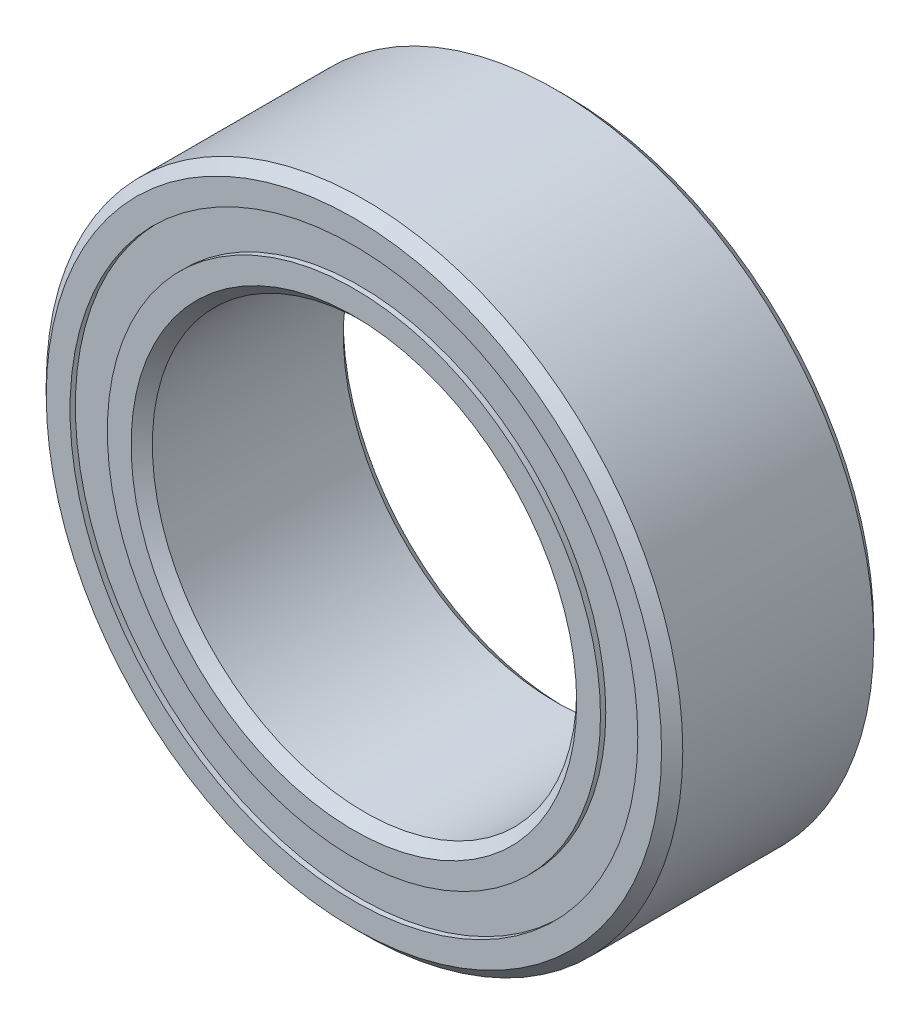
ISO-10303-21;
HEADER;
FILE_DESCRIPTION(('STEP AP214'),'2;1');
FILE_NAME('part.step','',(''),(''),'','','');
FILE_SCHEMA(('AUTOMOTIVE_DESIGN { 1 0 10303 214 1 1 1 1 }'));
ENDSEC;
DATA;
#1=APPLICATION_CONTEXT('core data for automotive mechanical design processes');
#2=APPLICATION_PROTOCOL_DEFINITION('international standard','automotive_design',2000,#1);
#3=PRODUCT_CONTEXT('',#1,'mechanical');
#4=PRODUCT('Part','Part','',(#3));
#5=PRODUCT_RELATED_PRODUCT_CATEGORY('part','',(#4));
#6=PRODUCT_DEFINITION_FORMATION('','',#4);
#7=PRODUCT_DEFINITION_CONTEXT('part definition',#1,'design');
#8=PRODUCT_DEFINITION('design','',#6,#7);
#9=PRODUCT_DEFINITION_SHAPE('','',#8);
#10=(LENGTH_UNIT() NAMED_UNIT(*) SI_UNIT(.MILLI.,.METRE.));
#11=(NAMED_UNIT(*) PLANE_ANGLE_UNIT() SI_UNIT($,.RADIAN.));
#12=(NAMED_UNIT(*) SI_UNIT($,.STERADIAN.) SOLID_ANGLE_UNIT());
#13=UNCERTAINTY_MEASURE_WITH_UNIT(LENGTH_MEASURE(1.E-05),#10,'distance_accuracy_value','');
#14=(GEOMETRIC_REPRESENTATION_CONTEXT(3) GLOBAL_UNCERTAINTY_ASSIGNED_CONTEXT((#13)) GLOBAL_UNIT_ASSIGNED_CONTEXT((#10,
#11,#12)) REPRESENTATION_CONTEXT('',''));
#15=CARTESIAN_POINT('',(0.,0.,0.));
#16=DIRECTION('',(0.,0.,1.));
#17=DIRECTION('',(1.,0.,0.));
#18=AXIS2_PLACEMENT_3D('',#15,#16,#17);
#19=CARTESIAN_POINT('',(0.,4.24787087912088,-1.508125));
#20=DIRECTION('',(0.,0.,1.));
#21=DIRECTION('',(1.,0.,0.));
#22=AXIS2_PLACEMENT_3D('',#19,#20,#21);
#23=PLANE('',#22);
#24=CARTESIAN_POINT('',(0.,0.,-1.508125));
#25=DIRECTION('',(0.,0.,1.));
#26=DIRECTION('',(1.,0.,0.));
#27=AXIS2_PLACEMENT_3D('',#24,#25,#26);
#28=CIRCLE('',#27,4.24787087912088);
#29=CARTESIAN_POINT('',(4.24787087912088,0.,-1.508125));
#30=VERTEX_POINT('',#29);
#31=EDGE_CURVE('E65',#30,#30,#28,.T.);
#32=ORIENTED_EDGE('',*,*,#31,.F.);
#33=EDGE_LOOP('',(#32));
#34=FACE_BOUND('',#33,.T.);
#35=CARTESIAN_POINT('',(0.,0.,-1.508125));
#36=DIRECTION('',(0.,0.,1.));
#37=DIRECTION('',(1.,0.,0.));
#38=AXIS2_PLACEMENT_3D('',#35,#36,#37);
#39=CIRCLE('',#38,3.68962912087912);
#40=CARTESIAN_POINT('',(3.68962912087912,0.,-1.508125));
#41=VERTEX_POINT('',#40);
#42=EDGE_CURVE('E11',#41,#41,#39,.T.);
#43=ORIENTED_EDGE('',*,*,#42,.T.);
#44=EDGE_LOOP('',(#43));
#45=FACE_BOUND('',#44,.T.);
#46=ADVANCED_FACE('F47',(#34,#45),#23,.F.);
#47=CARTESIAN_POINT('',(0.,0.,1.5875));
#48=DIRECTION('',(0.,0.,1.));
#49=DIRECTION('',(1.,0.,0.));
#50=AXIS2_PLACEMENT_3D('',#47,#48,#49);
#51=CYLINDRICAL_SURFACE('',#50,3.68962912087912);
#52=ORIENTED_EDGE('',*,*,#42,.F.);
#53=EDGE_LOOP('',(#52));
#54=FACE_BOUND('',#53,.T.);
#55=CARTESIAN_POINT('',(0.,0.,-0.758760243513405));
#56=DIRECTION('',(0.,0.,1.));
#57=DIRECTION('',(1.,0.,0.));
#58=AXIS2_PLACEMENT_3D('',#55,#56,#57);
#59=CIRCLE('',#58,3.68962912087912);
#60=CARTESIAN_POINT('',(3.68962912087912,0.,-0.758760243513405));
#61=VERTEX_POINT('',#60);
#62=EDGE_CURVE('E54',#61,#61,#59,.T.);
#63=ORIENTED_EDGE('',*,*,#62,.T.);
#64=EDGE_LOOP('',(#63));
#65=FACE_BOUND('',#64,.T.);
#66=ADVANCED_FACE('F74',(#54,#65),#51,.F.);
#67=CARTESIAN_POINT('',(0.,4.24787087912088,-0.758760243513405));
#68=DIRECTION('',(0.,0.,-1.));
#69=DIRECTION('',(-1.,0.,0.));
#70=AXIS2_PLACEMENT_3D('',#67,#68,#69);
#71=PLANE('',#70);
#72=ORIENTED_EDGE('',*,*,#62,.F.);
#73=EDGE_LOOP('',(#72));
#74=FACE_BOUND('',#73,.T.);
#75=CARTESIAN_POINT('',(0.,0.,-0.758760243513405));
#76=DIRECTION('',(0.,0.,1.));
#77=DIRECTION('',(1.,0.,0.));
#78=AXIS2_PLACEMENT_3D('',#75,#76,#77);
#79=CIRCLE('',#78,4.24787087912088);
#80=CARTESIAN_POINT('',(4.24787087912088,0.,-0.758760243513405));
#81=VERTEX_POINT('',#80);
#82=EDGE_CURVE('E60',#81,#81,#79,.T.);
#83=ORIENTED_EDGE('',*,*,#82,.T.);
#84=EDGE_LOOP('',(#83));
#85=FACE_BOUND('',#84,.T.);
#86=ADVANCED_FACE('F78',(#74,#85),#71,.F.);
#87=CARTESIAN_POINT('',(0.,0.,1.5875));
#88=DIRECTION('',(0.,0.,1.));
#89=DIRECTION('',(1.,0.,0.));
#90=AXIS2_PLACEMENT_3D('',#87,#88,#89);
#91=CYLINDRICAL_SURFACE('',#90,4.24787087912088);
#92=ORIENTED_EDGE('',*,*,#82,.F.);
#93=EDGE_LOOP('',(#92));
#94=FACE_BOUND('',#93,.T.);
#95=ORIENTED_EDGE('',*,*,#31,.T.);
#96=EDGE_LOOP('',(#95));
#97=FACE_BOUND('',#96,.T.);
#98=ADVANCED_FACE('F71',(#94,#97),#91,.T.);
#99=CLOSED_SHELL('',(#46,#66,#86,#98));
#100=MANIFOLD_SOLID_BREP('B2',#99);
#101=CARTESIAN_POINT('',(0.,4.24787087912088,1.508125));
#102=DIRECTION('',(0.,0.,-1.));
#103=DIRECTION('',(-1.,0.,0.));
#104=AXIS2_PLACEMENT_3D('',#101,#102,#103);
#105=PLANE('',#104);
#106=CARTESIAN_POINT('',(0.,0.,1.508125));
#107=DIRECTION('',(0.,0.,1.));
#108=DIRECTION('',(1.,0.,0.));
#109=AXIS2_PLACEMENT_3D('',#106,#107,#108);
#110=CIRCLE('',#109,3.68962912087912);
#111=CARTESIAN_POINT('',(3.68962912087912,0.,1.508125));
#112=VERTEX_POINT('',#111);
#113=EDGE_CURVE('E46',#112,#112,#110,.T.);
#114=ORIENTED_EDGE('',*,*,#113,.F.);
#115=EDGE_LOOP('',(#114));
#116=FACE_BOUND('',#115,.T.);
#117=CARTESIAN_POINT('',(0.,0.,1.508125));
#118=DIRECTION('',(0.,0.,1.));
#119=DIRECTION('',(1.,0.,0.));
#120=AXIS2_PLACEMENT_3D('',#117,#118,#119);
#121=CIRCLE('',#120,4.24787087912088);
#122=CARTESIAN_POINT('',(4.24787087912088,0.,1.508125));
#123=VERTEX_POINT('',#122);
#124=EDGE_CURVE('E140',#123,#123,#121,.T.);
#125=ORIENTED_EDGE('',*,*,#124,.T.);
#126=EDGE_LOOP('',(#125));
#127=FACE_BOUND('',#126,.T.);
#128=ADVANCED_FACE('F122',(#116,#127),#105,.F.);
#129=CARTESIAN_POINT('',(0.,0.,1.5875));
#130=DIRECTION('',(0.,0.,1.));
#131=DIRECTION('',(1.,0.,0.));
#132=AXIS2_PLACEMENT_3D('',#129,#130,#131);
#133=CYLINDRICAL_SURFACE('',#132,3.68962912087912);
#134=CARTESIAN_POINT('',(0.,0.,0.758760243513404));
#135=DIRECTION('',(0.,0.,1.));
#136=DIRECTION('',(1.,0.,0.));
#137=AXIS2_PLACEMENT_3D('',#134,#135,#136);
#138=CIRCLE('',#137,3.68962912087912);
#139=CARTESIAN_POINT('',(3.68962912087912,0.,0.758760243513404));
#140=VERTEX_POINT('',#139);
#141=EDGE_CURVE('E129',#140,#140,#138,.T.);
#142=ORIENTED_EDGE('',*,*,#141,.F.);
#143=EDGE_LOOP('',(#142));
#144=FACE_BOUND('',#143,.T.);
#145=ORIENTED_EDGE('',*,*,#113,.T.);
#146=EDGE_LOOP('',(#145));
#147=FACE_BOUND('',#146,.T.);
#148=ADVANCED_FACE('F155',(#144,#147),#133,.F.);
#149=CARTESIAN_POINT('',(0.,4.24787087912088,0.758760243513404));
#150=DIRECTION('',(0.,0.,1.));
#151=DIRECTION('',(1.,0.,0.));
#152=AXIS2_PLACEMENT_3D('',#149,#150,#151);
#153=PLANE('',#152);
#154=CARTESIAN_POINT('',(0.,0.,0.758760243513404));
#155=DIRECTION('',(0.,0.,1.));
#156=DIRECTION('',(1.,0.,0.));
#157=AXIS2_PLACEMENT_3D('',#154,#155,#156);
#158=CIRCLE('',#157,4.24787087912088);
#159=CARTESIAN_POINT('',(4.24787087912088,0.,0.758760243513404));
#160=VERTEX_POINT('',#159);
#161=EDGE_CURVE('E136',#160,#160,#158,.T.);
#162=ORIENTED_EDGE('',*,*,#161,.F.);
#163=EDGE_LOOP('',(#162));
#164=FACE_BOUND('',#163,.T.);
#165=ORIENTED_EDGE('',*,*,#141,.T.);
#166=EDGE_LOOP('',(#165));
#167=FACE_BOUND('',#166,.T.);
#168=ADVANCED_FACE('F150',(#164,#167),#153,.F.);
#169=CARTESIAN_POINT('',(0.,0.,1.5875));
#170=DIRECTION('',(0.,0.,1.));
#171=DIRECTION('',(1.,0.,0.));
#172=AXIS2_PLACEMENT_3D('',#169,#170,#171);
#173=CYLINDRICAL_SURFACE('',#172,4.24787087912088);
#174=ORIENTED_EDGE('',*,*,#124,.F.);
#175=EDGE_LOOP('',(#174));
#176=FACE_BOUND('',#175,.T.);
#177=ORIENTED_EDGE('',*,*,#161,.T.);
#178=EDGE_LOOP('',(#177));
#179=FACE_BOUND('',#178,.T.);
#180=ADVANCED_FACE('F147',(#176,#179),#173,.T.);
#181=CLOSED_SHELL('',(#128,#148,#168,#180));
#182=MANIFOLD_SOLID_BREP('B6',#181);
#183=CARTESIAN_POINT('',(-1.98437499999996,3.43703832126952,0.));
#184=DIRECTION('',(0.,0.,1.));
#185=DIRECTION('',(-0.499999999999989,0.866025403784445,0.));
#186=AXIS2_PLACEMENT_3D('',#183,#184,#185);
#187=SPHERICAL_SURFACE('',#186,0.758760243513404);
#188=CARTESIAN_POINT('',(-1.98437499999996,3.43703832126952,0.758760243513404));
#189=VERTEX_POINT('',#188);
#190=VERTEX_LOOP('',#189);
#191=FACE_BOUND('',#190,.T.);
#192=ADVANCED_FACE('F197',(#191),#187,.T.);
#193=CLOSED_SHELL('',(#192));
#194=MANIFOLD_SOLID_BREP('B41',#193);
#195=CARTESIAN_POINT('',(-3.43703832126947,1.98437500000004,0.));
#196=DIRECTION('',(0.,0.,1.));
#197=DIRECTION('',(-0.866025403784433,0.50000000000001,0.));
#198=AXIS2_PLACEMENT_3D('',#195,#196,#197);
#199=SPHERICAL_SURFACE('',#198,0.758760243513404);
#200=CARTESIAN_POINT('',(-3.43703832126947,1.98437500000004,0.758760243513404));
#201=VERTEX_POINT('',#200);
#202=VERTEX_LOOP('',#201);
#203=FACE_BOUND('',#202,.T.);
#204=ADVANCED_FACE('F218',(#203),#199,.T.);
#205=CLOSED_SHELL('',(#204));
#206=MANIFOLD_SOLID_BREP('B118',#205);
#207=CARTESIAN_POINT('',(-3.96875,0.,0.));
#208=DIRECTION('',(0.,0.,1.));
#209=DIRECTION('',(-1.,0.,0.));
#210=AXIS2_PLACEMENT_3D('',#207,#208,#209);
#211=SPHERICAL_SURFACE('',#210,0.758760243513404);
#212=CARTESIAN_POINT('',(-3.96875,0.,0.758760243513404));
#213=VERTEX_POINT('',#212);
#214=VERTEX_LOOP('',#213);
#215=FACE_BOUND('',#214,.T.);
#216=ADVANCED_FACE('F239',(#215),#211,.T.);
#217=CLOSED_SHELL('',(#216));
#218=MANIFOLD_SOLID_BREP('B193',#217);
#219=CARTESIAN_POINT('',(-3.43703832126951,-1.98437499999997,0.));
#220=DIRECTION('',(0.,0.,1.));
#221=DIRECTION('',(-0.866025403784443,-0.499999999999992,0.));
#222=AXIS2_PLACEMENT_3D('',#219,#220,#221);
#223=SPHERICAL_SURFACE('',#222,0.758760243513404);
#224=CARTESIAN_POINT('',(-3.43703832126951,-1.98437499999997,0.758760243513404));
#225=VERTEX_POINT('',#224);
#226=VERTEX_LOOP('',#225);
#227=FACE_BOUND('',#226,.T.);
#228=ADVANCED_FACE('F260',(#227),#223,.T.);
#229=CLOSED_SHELL('',(#228));
#230=MANIFOLD_SOLID_BREP('B214',#229);
#231=CARTESIAN_POINT('',(-1.98437500000003,-3.43703832126947,0.));
#232=DIRECTION('',(0.,0.,1.));
#233=DIRECTION('',(-0.500000000000007,-0.866025403784435,0.));
#234=AXIS2_PLACEMENT_3D('',#231,#232,#233);
#235=SPHERICAL_SURFACE('',#234,0.758760243513404);
#236=CARTESIAN_POINT('',(-1.98437500000003,-3.43703832126947,0.758760243513404));
#237=VERTEX_POINT('',#236);
#238=VERTEX_LOOP('',#237);
#239=FACE_BOUND('',#238,.T.);
#240=ADVANCED_FACE('F281',(#239),#235,.T.);
#241=CLOSED_SHELL('',(#240));
#242=MANIFOLD_SOLID_BREP('B235',#241);
#243=CARTESIAN_POINT('',(0.,-3.96875,0.));
#244=DIRECTION('',(0.,0.,1.));
#245=DIRECTION('',(0.,-1.,0.));
#246=AXIS2_PLACEMENT_3D('',#243,#244,#245);
#247=SPHERICAL_SURFACE('',#246,0.758760243513404);
#248=CARTESIAN_POINT('',(0.,-3.96875,0.758760243513404));
#249=VERTEX_POINT('',#248);
#250=VERTEX_LOOP('',#249);
#251=FACE_BOUND('',#250,.T.);
#252=ADVANCED_FACE('F302',(#251),#247,.T.);
#253=CLOSED_SHELL('',(#252));
#254=MANIFOLD_SOLID_BREP('B256',#253);
#255=CARTESIAN_POINT('',(1.98437499999998,-3.4370383212695,0.));
#256=DIRECTION('',(0.,0.,1.));
#257=DIRECTION('',(0.499999999999995,-0.866025403784442,0.));
#258=AXIS2_PLACEMENT_3D('',#255,#256,#257);
#259=SPHERICAL_SURFACE('',#258,0.758760243513404);
#260=CARTESIAN_POINT('',(1.98437499999998,-3.4370383212695,0.758760243513404));
#261=VERTEX_POINT('',#260);
#262=VERTEX_LOOP('',#261);
#263=FACE_BOUND('',#262,.T.);
#264=ADVANCED_FACE('F323',(#263),#259,.T.);
#265=CLOSED_SHELL('',(#264));
#266=MANIFOLD_SOLID_BREP('B277',#265);
#267=CARTESIAN_POINT('',(3.43703832126948,-1.98437500000002,0.));
#268=DIRECTION('',(0.,0.,1.));
#269=DIRECTION('',(0.866025403784436,-0.500000000000004,0.));
#270=AXIS2_PLACEMENT_3D('',#267,#268,#269);
#271=SPHERICAL_SURFACE('',#270,0.758760243513404);
#272=CARTESIAN_POINT('',(3.43703832126948,-1.98437500000002,0.758760243513404));
#273=VERTEX_POINT('',#272);
#274=VERTEX_LOOP('',#273);
#275=FACE_BOUND('',#274,.T.);
#276=ADVANCED_FACE('F344',(#275),#271,.T.);
#277=CLOSED_SHELL('',(#276));
#278=MANIFOLD_SOLID_BREP('B298',#277);
#279=CARTESIAN_POINT('',(3.96875,0.,0.));
#280=DIRECTION('',(0.,0.,1.));
#281=DIRECTION('',(1.,0.,0.));
#282=AXIS2_PLACEMENT_3D('',#279,#280,#281);
#283=SPHERICAL_SURFACE('',#282,0.758760243513404);
#284=CARTESIAN_POINT('',(3.96875,0.,0.758760243513404));
#285=VERTEX_POINT('',#284);
#286=VERTEX_LOOP('',#285);
#287=FACE_BOUND('',#286,.T.);
#288=ADVANCED_FACE('F365',(#287),#283,.T.);
#289=CLOSED_SHELL('',(#288));
#290=MANIFOLD_SOLID_BREP('B319',#289);
#291=CARTESIAN_POINT('',(3.4370383212695,1.98437499999999,0.));
#292=DIRECTION('',(0.,0.,1.));
#293=DIRECTION('',(0.86602540378444,0.499999999999998,0.));
#294=AXIS2_PLACEMENT_3D('',#291,#292,#293);
#295=SPHERICAL_SURFACE('',#294,0.758760243513404);
#296=CARTESIAN_POINT('',(3.4370383212695,1.98437499999999,0.758760243513404));
#297=VERTEX_POINT('',#296);
#298=VERTEX_LOOP('',#297);
#299=FACE_BOUND('',#298,.T.);
#300=ADVANCED_FACE('F386',(#299),#295,.T.);
#301=CLOSED_SHELL('',(#300));
#302=MANIFOLD_SOLID_BREP('B340',#301);
#303=CARTESIAN_POINT('',(1.984375,3.43703832126949,0.));
#304=DIRECTION('',(0.,0.,1.));
#305=DIRECTION('',(0.500000000000001,0.866025403784438,0.));
#306=AXIS2_PLACEMENT_3D('',#303,#304,#305);
#307=SPHERICAL_SURFACE('',#306,0.758760243513404);
#308=CARTESIAN_POINT('',(1.984375,3.43703832126949,0.758760243513404));
#309=VERTEX_POINT('',#308);
#310=VERTEX_LOOP('',#309);
#311=FACE_BOUND('',#310,.T.);
#312=ADVANCED_FACE('F407',(#311),#307,.T.);
#313=CLOSED_SHELL('',(#312));
#314=MANIFOLD_SOLID_BREP('B361',#313);
#315=CARTESIAN_POINT('',(0.,3.96875,0.));
#316=DIRECTION('',(0.,0.,1.));
#317=DIRECTION('',(0.,1.,0.));
#318=AXIS2_PLACEMENT_3D('',#315,#316,#317);
#319=SPHERICAL_SURFACE('',#318,0.758760243513404);
#320=CARTESIAN_POINT('',(0.,3.96875,0.758760243513404));
#321=VERTEX_POINT('',#320);
#322=VERTEX_LOOP('',#321);
#323=FACE_BOUND('',#322,.T.);
#324=ADVANCED_FACE('F430',(#323),#319,.T.);
#325=CLOSED_SHELL('',(#324));
#326=MANIFOLD_SOLID_BREP('B382',#325);
#327=CARTESIAN_POINT('',(0.,3.68962912087912,1.5875));
#328=DIRECTION('',(0.,0.,-1.));
#329=DIRECTION('',(-1.,0.,0.));
#330=AXIS2_PLACEMENT_3D('',#327,#328,#329);
#331=PLANE('',#330);
#332=CARTESIAN_POINT('',(0.,0.,1.5875));
#333=DIRECTION('',(0.,0.,1.));
#334=DIRECTION('',(1.,0.,0.));
#335=AXIS2_PLACEMENT_3D('',#332,#333,#334);
#336=CIRCLE('',#335,3.33375);
#337=CARTESIAN_POINT('',(3.33375,0.,1.5875));
#338=VERTEX_POINT('',#337);
#339=EDGE_CURVE('E486',#338,#338,#336,.T.);
#340=ORIENTED_EDGE('',*,*,#339,.F.);
#341=EDGE_LOOP('',(#340));
#342=FACE_BOUND('',#341,.T.);
#343=CARTESIAN_POINT('',(0.,0.,1.5875));
#344=DIRECTION('',(0.,0.,1.));
#345=DIRECTION('',(1.,0.,0.));
#346=AXIS2_PLACEMENT_3D('',#343,#344,#345);
#347=CIRCLE('',#346,3.68962912087912);
#348=CARTESIAN_POINT('',(3.68962912087912,0.,1.5875));
#349=VERTEX_POINT('',#348);
#350=EDGE_CURVE('E429',#349,#349,#347,.T.);
#351=ORIENTED_EDGE('',*,*,#350,.T.);
#352=EDGE_LOOP('',(#351));
#353=FACE_BOUND('',#352,.T.);
#354=ADVANCED_FACE('F450',(#342,#353),#331,.F.);
#355=CARTESIAN_POINT('',(0.,0.,1.5875));
#356=DIRECTION('',(0.,0.,1.));
#357=DIRECTION('',(1.,0.,0.));
#358=AXIS2_PLACEMENT_3D('',#355,#356,#357);
#359=CYLINDRICAL_SURFACE('',#358,3.68962912087912);
#360=ORIENTED_EDGE('',*,*,#350,.F.);
#361=EDGE_LOOP('',(#360));
#362=FACE_BOUND('',#361,.T.);
#363=CARTESIAN_POINT('',(0.,0.,0.705555555555556));
#364=DIRECTION('',(0.,0.,1.));
#365=DIRECTION('',(1.,0.,0.));
#366=AXIS2_PLACEMENT_3D('',#363,#364,#365);
#367=CIRCLE('',#366,3.68962912087912);
#368=CARTESIAN_POINT('',(3.68962912087912,0.,0.705555555555556));
#369=VERTEX_POINT('',#368);
#370=EDGE_CURVE('E457',#369,#369,#367,.T.);
#371=ORIENTED_EDGE('',*,*,#370,.T.);
#372=EDGE_LOOP('',(#371));
#373=FACE_BOUND('',#372,.T.);
#374=ADVANCED_FACE('F493',(#362,#373),#359,.T.);
#375=CARTESIAN_POINT('',(0.,0.,0.));
#376=DIRECTION('',(0.,0.,1.));
#377=DIRECTION('',(1.,0.,0.));
#378=AXIS2_PLACEMENT_3D('',#375,#376,#377);
#379=TOROIDAL_SURFACE('',#378,3.96874999999999,0.758760243513403);
#380=ORIENTED_EDGE('',*,*,#370,.F.);
#381=EDGE_LOOP('',(#380));
#382=FACE_BOUND('',#381,.T.);
#383=CARTESIAN_POINT('',(0.,0.,-0.705555555555557));
#384=DIRECTION('',(0.,0.,1.));
#385=DIRECTION('',(1.,0.,0.));
#386=AXIS2_PLACEMENT_3D('',#383,#384,#385);
#387=CIRCLE('',#386,3.68962912087912);
#388=CARTESIAN_POINT('',(3.68962912087912,0.,-0.705555555555557));
#389=VERTEX_POINT('',#388);
#390=EDGE_CURVE('E463',#389,#389,#387,.T.);
#391=ORIENTED_EDGE('',*,*,#390,.T.);
#392=EDGE_LOOP('',(#391));
#393=FACE_BOUND('',#392,.T.);
#394=ADVANCED_FACE('F497',(#382,#393),#379,.F.);
#395=CARTESIAN_POINT('',(0.,0.,1.5875));
#396=DIRECTION('',(0.,0.,1.));
#397=DIRECTION('',(1.,0.,0.));
#398=AXIS2_PLACEMENT_3D('',#395,#396,#397);
#399=CYLINDRICAL_SURFACE('',#398,3.68962912087912);
#400=ORIENTED_EDGE('',*,*,#390,.F.);
#401=EDGE_LOOP('',(#400));
#402=FACE_BOUND('',#401,.T.);
#403=CARTESIAN_POINT('',(0.,0.,-1.5875));
#404=DIRECTION('',(0.,0.,1.));
#405=DIRECTION('',(1.,0.,0.));
#406=AXIS2_PLACEMENT_3D('',#403,#404,#405);
#407=CIRCLE('',#406,3.68962912087912);
#408=CARTESIAN_POINT('',(3.68962912087912,0.,-1.5875));
#409=VERTEX_POINT('',#408);
#410=EDGE_CURVE('E469',#409,#409,#407,.T.);
#411=ORIENTED_EDGE('',*,*,#410,.T.);
#412=EDGE_LOOP('',(#411));
#413=FACE_BOUND('',#412,.T.);
#414=ADVANCED_FACE('F502',(#402,#413),#399,.T.);
#415=CARTESIAN_POINT('',(0.,3.33375,-1.5875));
#416=DIRECTION('',(0.,0.,1.));
#417=DIRECTION('',(1.,0.,0.));
#418=AXIS2_PLACEMENT_3D('',#415,#416,#417);
#419=PLANE('',#418);
#420=ORIENTED_EDGE('',*,*,#410,.F.);
#421=EDGE_LOOP('',(#420));
#422=FACE_BOUND('',#421,.T.);
#423=CARTESIAN_POINT('',(0.,0.,-1.5875));
#424=DIRECTION('',(0.,0.,1.));
#425=DIRECTION('',(1.,0.,0.));
#426=AXIS2_PLACEMENT_3D('',#423,#424,#425);
#427=CIRCLE('',#426,3.33375);
#428=CARTESIAN_POINT('',(3.33375,0.,-1.5875));
#429=VERTEX_POINT('',#428);
#430=EDGE_CURVE('E475',#429,#429,#427,.T.);
#431=ORIENTED_EDGE('',*,*,#430,.T.);
#432=EDGE_LOOP('',(#431));
#433=FACE_BOUND('',#432,.T.);
#434=ADVANCED_FACE('F508',(#422,#433),#419,.F.);
#435=CARTESIAN_POINT('',(0.,0.,-1.42875));
#436=DIRECTION('',(0.,0.,-1.));
#437=DIRECTION('',(-1.,0.,0.));
#438=AXIS2_PLACEMENT_3D('',#435,#436,#437);
#439=CONICAL_SURFACE('',#438,3.175,0.785398163397451);
#440=ORIENTED_EDGE('',*,*,#430,.F.);
#441=EDGE_LOOP('',(#440));
#442=FACE_BOUND('',#441,.T.);
#443=CARTESIAN_POINT('',(0.,0.,-1.42875));
#444=DIRECTION('',(0.,0.,1.));
#445=DIRECTION('',(1.,0.,0.));
#446=AXIS2_PLACEMENT_3D('',#443,#444,#445);
#447=CIRCLE('',#446,3.175);
#448=CARTESIAN_POINT('',(3.175,0.,-1.42875));
#449=VERTEX_POINT('',#448);
#450=EDGE_CURVE('E479',#449,#449,#447,.T.);
#451=ORIENTED_EDGE('',*,*,#450,.T.);
#452=EDGE_LOOP('',(#451));
#453=FACE_BOUND('',#452,.T.);
#454=ADVANCED_FACE('F512',(#442,#453),#439,.F.);
#455=CARTESIAN_POINT('',(0.,0.,1.5875));
#456=DIRECTION('',(0.,0.,1.));
#457=DIRECTION('',(1.,0.,0.));
#458=AXIS2_PLACEMENT_3D('',#455,#456,#457);
#459=CYLINDRICAL_SURFACE('',#458,3.175);
#460=ORIENTED_EDGE('',*,*,#450,.F.);
#461=EDGE_LOOP('',(#460));
#462=FACE_BOUND('',#461,.T.);
#463=CARTESIAN_POINT('',(0.,0.,1.42875));
#464=DIRECTION('',(0.,0.,1.));
#465=DIRECTION('',(1.,0.,0.));
#466=AXIS2_PLACEMENT_3D('',#463,#464,#465);
#467=CIRCLE('',#466,3.175);
#468=CARTESIAN_POINT('',(3.175,0.,1.42875));
#469=VERTEX_POINT('',#468);
#470=EDGE_CURVE('E483',#469,#469,#467,.T.);
#471=ORIENTED_EDGE('',*,*,#470,.T.);
#472=EDGE_LOOP('',(#471));
#473=FACE_BOUND('',#472,.T.);
#474=ADVANCED_FACE('F516',(#462,#473),#459,.F.);
#475=CARTESIAN_POINT('',(0.,0.,1.5875));
#476=DIRECTION('',(0.,0.,1.));
#477=DIRECTION('',(1.,0.,0.));
#478=AXIS2_PLACEMENT_3D('',#475,#476,#477);
#479=CONICAL_SURFACE('',#478,3.33375,0.785398163397448);
#480=ORIENTED_EDGE('',*,*,#470,.F.);
#481=EDGE_LOOP('',(#480));
#482=FACE_BOUND('',#481,.T.);
#483=ORIENTED_EDGE('',*,*,#339,.T.);
#484=EDGE_LOOP('',(#483));
#485=FACE_BOUND('',#484,.T.);
#486=ADVANCED_FACE('F490',(#482,#485),#479,.F.);
#487=CLOSED_SHELL('',(#354,#374,#394,#414,#434,#454,#474,#486));
#488=MANIFOLD_SOLID_BREP('B403',#487);
#489=CARTESIAN_POINT('',(0.,0.,1.42875));
#490=DIRECTION('',(0.,0.,-1.));
#491=DIRECTION('',(-1.,0.,0.));
#492=AXIS2_PLACEMENT_3D('',#489,#490,#491);
#493=CONICAL_SURFACE('',#492,4.7625,0.785398163397445);
#494=CARTESIAN_POINT('',(0.,0.,1.5875));
#495=DIRECTION('',(0.,0.,1.));
#496=DIRECTION('',(1.,0.,0.));
#497=AXIS2_PLACEMENT_3D('',#494,#495,#496);
#498=CIRCLE('',#497,4.60375);
#499=CARTESIAN_POINT('',(4.60375,0.,1.5875));
#500=VERTEX_POINT('',#499);
#501=EDGE_CURVE('E623',#500,#500,#498,.T.);
#502=ORIENTED_EDGE('',*,*,#501,.F.);
#503=EDGE_LOOP('',(#502));
#504=FACE_BOUND('',#503,.T.);
#505=CARTESIAN_POINT('',(0.,0.,1.42875));
#506=DIRECTION('',(0.,0.,1.));
#507=DIRECTION('',(1.,0.,0.));
#508=AXIS2_PLACEMENT_3D('',#505,#506,#507);
#509=CIRCLE('',#508,4.7625);
#510=CARTESIAN_POINT('',(4.7625,0.,1.42875));
#511=VERTEX_POINT('',#510);
#512=EDGE_CURVE('E449',#511,#511,#509,.T.);
#513=ORIENTED_EDGE('',*,*,#512,.T.);
#514=EDGE_LOOP('',(#513));
#515=FACE_BOUND('',#514,.T.);
#516=ADVANCED_FACE('F587',(#504,#515),#493,.T.);
#517=CARTESIAN_POINT('',(0.,0.,1.5875));
#518=DIRECTION('',(0.,0.,1.));
#519=DIRECTION('',(1.,0.,0.));
#520=AXIS2_PLACEMENT_3D('',#517,#518,#519);
#521=CYLINDRICAL_SURFACE('',#520,4.7625);
#522=ORIENTED_EDGE('',*,*,#512,.F.);
#523=EDGE_LOOP('',(#522));
#524=FACE_BOUND('',#523,.T.);
#525=CARTESIAN_POINT('',(0.,0.,-1.42875));
#526=DIRECTION('',(0.,0.,1.));
#527=DIRECTION('',(1.,0.,0.));
#528=AXIS2_PLACEMENT_3D('',#525,#526,#527);
#529=CIRCLE('',#528,4.7625);
#530=CARTESIAN_POINT('',(4.7625,0.,-1.42875));
#531=VERTEX_POINT('',#530);
#532=EDGE_CURVE('E594',#531,#531,#529,.T.);
#533=ORIENTED_EDGE('',*,*,#532,.T.);
#534=EDGE_LOOP('',(#533));
#535=FACE_BOUND('',#534,.T.);
#536=ADVANCED_FACE('F630',(#524,#535),#521,.T.);
#537=CARTESIAN_POINT('',(0.,0.,-1.5875));
#538=DIRECTION('',(0.,0.,1.));
#539=DIRECTION('',(1.,0.,0.));
#540=AXIS2_PLACEMENT_3D('',#537,#538,#539);
#541=CONICAL_SURFACE('',#540,4.60375,0.785398163397444);
#542=ORIENTED_EDGE('',*,*,#532,.F.);
#543=EDGE_LOOP('',(#542));
#544=FACE_BOUND('',#543,.T.);
#545=CARTESIAN_POINT('',(0.,0.,-1.5875));
#546=DIRECTION('',(0.,0.,1.));
#547=DIRECTION('',(1.,0.,0.));
#548=AXIS2_PLACEMENT_3D('',#545,#546,#547);
#549=CIRCLE('',#548,4.60375);
#550=CARTESIAN_POINT('',(4.60375,0.,-1.5875));
#551=VERTEX_POINT('',#550);
#552=EDGE_CURVE('E600',#551,#551,#549,.T.);
#553=ORIENTED_EDGE('',*,*,#552,.T.);
#554=EDGE_LOOP('',(#553));
#555=FACE_BOUND('',#554,.T.);
#556=ADVANCED_FACE('F634',(#544,#555),#541,.T.);
#557=CARTESIAN_POINT('',(0.,4.60375,-1.5875));
#558=DIRECTION('',(0.,0.,1.));
#559=DIRECTION('',(1.,0.,0.));
#560=AXIS2_PLACEMENT_3D('',#557,#558,#559);
#561=PLANE('',#560);
#562=ORIENTED_EDGE('',*,*,#552,.F.);
#563=EDGE_LOOP('',(#562));
#564=FACE_BOUND('',#563,.T.);
#565=CARTESIAN_POINT('',(0.,0.,-1.5875));
#566=DIRECTION('',(0.,0.,1.));
#567=DIRECTION('',(1.,0.,0.));
#568=AXIS2_PLACEMENT_3D('',#565,#566,#567);
#569=CIRCLE('',#568,4.24787087912088);
#570=CARTESIAN_POINT('',(4.24787087912088,0.,-1.5875));
#571=VERTEX_POINT('',#570);
#572=EDGE_CURVE('E606',#571,#571,#569,.T.);
#573=ORIENTED_EDGE('',*,*,#572,.T.);
#574=EDGE_LOOP('',(#573));
#575=FACE_BOUND('',#574,.T.);
#576=ADVANCED_FACE('F639',(#564,#575),#561,.F.);
#577=CARTESIAN_POINT('',(0.,0.,1.5875));
#578=DIRECTION('',(0.,0.,1.));
#579=DIRECTION('',(1.,0.,0.));
#580=AXIS2_PLACEMENT_3D('',#577,#578,#579);
#581=CYLINDRICAL_SURFACE('',#580,4.24787087912088);
#582=ORIENTED_EDGE('',*,*,#572,.F.);
#583=EDGE_LOOP('',(#582));
#584=FACE_BOUND('',#583,.T.);
#585=CARTESIAN_POINT('',(0.,0.,-0.705555555555556));
#586=DIRECTION('',(0.,0.,1.));
#587=DIRECTION('',(1.,0.,0.));
#588=AXIS2_PLACEMENT_3D('',#585,#586,#587);
#589=CIRCLE('',#588,4.24787087912088);
#590=CARTESIAN_POINT('',(4.24787087912088,0.,-0.705555555555556));
#591=VERTEX_POINT('',#590);
#592=EDGE_CURVE('E612',#591,#591,#589,.T.);
#593=ORIENTED_EDGE('',*,*,#592,.T.);
#594=EDGE_LOOP('',(#593));
#595=FACE_BOUND('',#594,.T.);
#596=ADVANCED_FACE('F645',(#584,#595),#581,.F.);
#597=CARTESIAN_POINT('',(0.,0.,0.));
#598=DIRECTION('',(0.,0.,1.));
#599=DIRECTION('',(1.,0.,0.));
#600=AXIS2_PLACEMENT_3D('',#597,#598,#599);
#601=TOROIDAL_SURFACE('',#600,3.96875,0.758760243513404);
#602=ORIENTED_EDGE('',*,*,#592,.F.);
#603=EDGE_LOOP('',(#602));
#604=FACE_BOUND('',#603,.T.);
#605=CARTESIAN_POINT('',(0.,0.,0.705555555555555));
#606=DIRECTION('',(0.,0.,1.));
#607=DIRECTION('',(1.,0.,0.));
#608=AXIS2_PLACEMENT_3D('',#605,#606,#607);
#609=CIRCLE('',#608,4.24787087912088);
#610=CARTESIAN_POINT('',(4.24787087912088,0.,0.705555555555555));
#611=VERTEX_POINT('',#610);
#612=EDGE_CURVE('E615',#611,#611,#609,.T.);
#613=ORIENTED_EDGE('',*,*,#612,.T.);
#614=EDGE_LOOP('',(#613));
#615=FACE_BOUND('',#614,.T.);
#616=ADVANCED_FACE('F649',(#604,#615),#601,.F.);
#617=CARTESIAN_POINT('',(0.,0.,1.5875));
#618=DIRECTION('',(0.,0.,1.));
#619=DIRECTION('',(1.,0.,0.));
#620=AXIS2_PLACEMENT_3D('',#617,#618,#619);
#621=CYLINDRICAL_SURFACE('',#620,4.24787087912088);
#622=ORIENTED_EDGE('',*,*,#612,.F.);
#623=EDGE_LOOP('',(#622));
#624=FACE_BOUND('',#623,.T.);
#625=CARTESIAN_POINT('',(0.,0.,1.5875));
#626=DIRECTION('',(0.,0.,1.));
#627=DIRECTION('',(1.,0.,0.));
#628=AXIS2_PLACEMENT_3D('',#625,#626,#627);
#629=CIRCLE('',#628,4.24787087912088);
#630=CARTESIAN_POINT('',(4.24787087912088,0.,1.5875));
#631=VERTEX_POINT('',#630);
#632=EDGE_CURVE('E619',#631,#631,#629,.T.);
#633=ORIENTED_EDGE('',*,*,#632,.T.);
#634=EDGE_LOOP('',(#633));
#635=FACE_BOUND('',#634,.T.);
#636=ADVANCED_FACE('F653',(#624,#635),#621,.F.);
#637=CARTESIAN_POINT('',(0.,4.60375,1.5875));
#638=DIRECTION('',(0.,0.,-1.));
#639=DIRECTION('',(-1.,0.,0.));
#640=AXIS2_PLACEMENT_3D('',#637,#638,#639);
#641=PLANE('',#640);
#642=ORIENTED_EDGE('',*,*,#632,.F.);
#643=EDGE_LOOP('',(#642));
#644=FACE_BOUND('',#643,.T.);
#645=ORIENTED_EDGE('',*,*,#501,.T.);
#646=EDGE_LOOP('',(#645));
#647=FACE_BOUND('',#646,.T.);
#648=ADVANCED_FACE('F627',(#644,#647),#641,.F.);
#649=CLOSED_SHELL('',(#516,#536,#556,#576,#596,#616,#636,#648));
#650=MANIFOLD_SOLID_BREP('B424',#649);
#651=ADVANCED_BREP_SHAPE_REPRESENTATION('',(#18,#100,#182,#194,#206,#218,#230,#242,#254,#266,
#278,#290,#302,#314,#326,#488,#650),#14);
#652=SHAPE_DEFINITION_REPRESENTATION(#9,#651);
ENDSEC;
END-ISO-10303-21;
